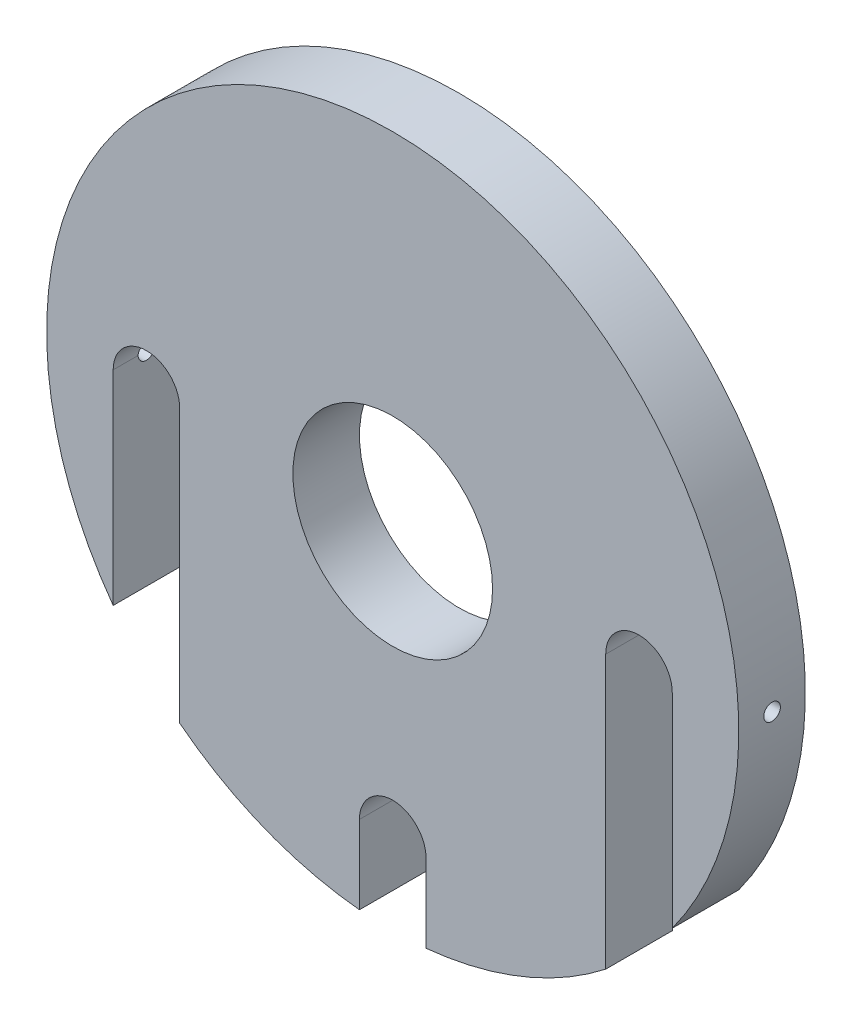
ISO-10303-21;
HEADER;
FILE_DESCRIPTION(('STEP AP214'),'2;1');
FILE_NAME('part.step','',(''),(''),'','','');
FILE_SCHEMA(('AUTOMOTIVE_DESIGN { 1 0 10303 214 1 1 1 1 }'));
ENDSEC;
DATA;
#1=APPLICATION_CONTEXT('core data for automotive mechanical design processes');
#2=APPLICATION_PROTOCOL_DEFINITION('international standard','automotive_design',2000,#1);
#3=PRODUCT_CONTEXT('',#1,'mechanical');
#4=PRODUCT('Part','Part','',(#3));
#5=PRODUCT_RELATED_PRODUCT_CATEGORY('part','',(#4));
#6=PRODUCT_DEFINITION_FORMATION('','',#4);
#7=PRODUCT_DEFINITION_CONTEXT('part definition',#1,'design');
#8=PRODUCT_DEFINITION('design','',#6,#7);
#9=PRODUCT_DEFINITION_SHAPE('','',#8);
#10=(LENGTH_UNIT() NAMED_UNIT(*) SI_UNIT(.MILLI.,.METRE.));
#11=(NAMED_UNIT(*) PLANE_ANGLE_UNIT() SI_UNIT($,.RADIAN.));
#12=(NAMED_UNIT(*) SI_UNIT($,.STERADIAN.) SOLID_ANGLE_UNIT());
#13=UNCERTAINTY_MEASURE_WITH_UNIT(LENGTH_MEASURE(1.E-05),#10,'distance_accuracy_value','');
#14=(GEOMETRIC_REPRESENTATION_CONTEXT(3) GLOBAL_UNCERTAINTY_ASSIGNED_CONTEXT((#13)) GLOBAL_UNIT_ASSIGNED_CONTEXT((#10,
#11,#12)) REPRESENTATION_CONTEXT('',''));
#15=CARTESIAN_POINT('',(0.,0.,0.));
#16=DIRECTION('',(0.,0.,1.));
#17=DIRECTION('',(1.,0.,0.));
#18=AXIS2_PLACEMENT_3D('',#15,#16,#17);
#19=CARTESIAN_POINT('',(0.,0.,10.));
#20=DIRECTION('',(0.,0.,-1.));
#21=DIRECTION('',(-1.,0.,0.));
#22=AXIS2_PLACEMENT_3D('',#19,#20,#21);
#23=CYLINDRICAL_SURFACE('',#22,52.);
#24=CARTESIAN_POINT('',(-52.,0.,6.24999999999998));
#25=CARTESIAN_POINT('',(-51.9999997973088,-0.0702021682379091,6.2499968895859));
#26=CARTESIAN_POINT('',(-51.9998563106322,-0.140454981450219,6.24406613697119));
#27=CARTESIAN_POINT('',(-51.9992977076912,-0.279025062442822,6.22048990731504));
#28=CARTESIAN_POINT('',(-51.9988822660825,-0.347339909542774,6.20283039859609));
#29=CARTESIAN_POINT('',(-51.9978268062926,-0.480006521059341,6.15630034243218));
#30=CARTESIAN_POINT('',(-51.9971868970592,-0.544360190296536,6.12743523302246));
#31=CARTESIAN_POINT('',(-51.99575470482,-0.667290330916391,6.05932103250131));
#32=CARTESIAN_POINT('',(-51.9949624592714,-0.725868217133678,6.02007449314121));
#33=CARTESIAN_POINT('',(-51.9933145118695,-0.835622281287134,5.93229518490517));
#34=CARTESIAN_POINT('',(-51.9924587919931,-0.886796344683112,5.88375977227363));
#35=CARTESIAN_POINT('',(-51.9907805017499,-0.980272477518451,5.77878464423165));
#36=CARTESIAN_POINT('',(-51.9899579326977,-1.02257419539248,5.72234461574973));
#37=CARTESIAN_POINT('',(-51.9884386379106,-1.09710658397418,5.60315653739074));
#38=CARTESIAN_POINT('',(-51.9877419250816,-1.12933622208278,5.54040784161421));
#39=CARTESIAN_POINT('',(-51.9865530394971,-1.18280274961246,5.41038828850494));
#40=CARTESIAN_POINT('',(-51.9860608660679,-1.2040396752478,5.34311744607073));
#41=CARTESIAN_POINT('',(-51.9853366659506,-1.23491404263499,5.20597695611337));
#42=CARTESIAN_POINT('',(-51.9851045888189,-1.24455373360457,5.13610781522614));
#43=CARTESIAN_POINT('',(-51.9849265963996,-1.25196691572491,4.99574265089226));
#44=CARTESIAN_POINT('',(-51.9849806801941,-1.2497404449398,4.92524662945722));
#45=CARTESIAN_POINT('',(-51.985368863679,-1.23348643261604,4.78564409487549));
#46=CARTESIAN_POINT('',(-51.9857029055237,-1.21946132894386,4.71653729770342));
#47=CARTESIAN_POINT('',(-51.9866132562613,-1.1800119384044,4.58165935292268));
#48=CARTESIAN_POINT('',(-51.9871895655884,-1.15458763111172,4.51588821129117));
#49=CARTESIAN_POINT('',(-51.9885195484886,-1.09305874317991,4.38954078401926));
#50=CARTESIAN_POINT('',(-51.9892732406284,-1.05695304442013,4.32896504308654));
#51=CARTESIAN_POINT('',(-51.990873002452,-0.97508713050876,4.21473394256006));
#52=CARTESIAN_POINT('',(-51.9917190722579,-0.929326902589633,4.16107859211825));
#53=CARTESIAN_POINT('',(-51.9934084662207,-0.829437096207218,4.06219713975511));
#54=CARTESIAN_POINT('',(-51.9942517896282,-0.77530540162422,4.01697317549234));
#55=CARTESIAN_POINT('',(-51.9958404123069,-0.660216745710646,3.93625470582223));
#56=CARTESIAN_POINT('',(-51.9965857115635,-0.599259783359249,3.90076020187007));
#57=CARTESIAN_POINT('',(-51.9978942729366,-0.472249784187237,3.84050847217416));
#58=CARTESIAN_POINT('',(-51.9984575339415,-0.406196716252543,3.81575131199297));
#59=CARTESIAN_POINT('',(-51.9993385031685,-0.270870063484839,3.77767840062746));
#60=CARTESIAN_POINT('',(-51.9996562118238,-0.201596484331865,3.76436262926472));
#61=CARTESIAN_POINT('',(-52.0000102059479,-0.0618138289347149,3.7495531009642));
#62=CARTESIAN_POINT('',(-52.000046561819,0.00869493380591818,3.74805638656743));
#63=CARTESIAN_POINT('',(-51.9998339383627,0.148962758512663,3.75691975412827));
#64=CARTESIAN_POINT('',(-51.9995849592427,0.218721821024188,3.76727982745936));
#65=CARTESIAN_POINT('',(-51.9988297750903,0.355501780963677,3.79956023565669));
#66=CARTESIAN_POINT('',(-51.9983235998992,0.422522995077548,3.82147922940406));
#67=CARTESIAN_POINT('',(-51.9971110723133,0.551934463575331,3.8762539091937));
#68=CARTESIAN_POINT('',(-51.9964047196695,0.614324712193831,3.90910960885154));
#69=CARTESIAN_POINT('',(-51.9948712563162,0.732716819717158,3.98483266008584));
#70=CARTESIAN_POINT('',(-51.9940441215981,0.788717404551271,4.02770200316391));
#71=CARTESIAN_POINT('',(-51.9923624047139,0.892727732221843,4.12223250589846));
#72=CARTESIAN_POINT('',(-51.9915078224988,0.940737460803128,4.17389368123867));
#73=CARTESIAN_POINT('',(-51.9898673530022,1.02741309597303,4.28455402755676));
#74=CARTESIAN_POINT('',(-51.9890814797713,1.06607709425557,4.34355469346742));
#75=CARTESIAN_POINT('',(-51.9876672523362,1.13295066954025,4.46721152634058));
#76=CARTESIAN_POINT('',(-51.9870388978446,1.16116026562596,4.53186768297923));
#77=CARTESIAN_POINT('',(-51.9860106523504,1.20632093427851,4.66499293625244));
#78=CARTESIAN_POINT('',(-51.9856107362014,1.22327324608078,4.73346161229381));
#79=CARTESIAN_POINT('',(-51.9850843853326,1.2454421997953,4.87227432871524));
#80=CARTESIAN_POINT('',(-51.9849579506351,1.25065884075391,4.94261836924769));
#81=CARTESIAN_POINT('',(-51.9849928270816,1.24920821155983,5.08316579760952));
#82=CARTESIAN_POINT('',(-51.9851540651841,1.24254395802412,5.1533692166126));
#83=CARTESIAN_POINT('',(-51.9857459567771,1.2175269006696,5.29166052483359));
#84=CARTESIAN_POINT('',(-51.9861766108046,1.19917407354676,5.35974840983338));
#85=CARTESIAN_POINT('',(-51.9872587776231,1.15130109720322,5.49187742806503));
#86=CARTESIAN_POINT('',(-51.9879102943159,1.12178075069791,5.55591848978267));
#87=CARTESIAN_POINT('',(-51.9893607075731,1.05241220497476,5.67813381072752));
#88=CARTESIAN_POINT('',(-51.9901595986442,1.01256439069638,5.73630828850982));
#89=CARTESIAN_POINT('',(-51.9918148783833,0.923664897688957,5.84515186657948));
#90=CARTESIAN_POINT('',(-51.9926712755141,0.874611862405308,5.8958198586795));
#91=CARTESIAN_POINT('',(-51.9943451605303,0.768681394127143,5.98821499771678));
#92=CARTESIAN_POINT('',(-51.9951626387157,0.711802024121723,6.02993992469413));
#93=CARTESIAN_POINT('',(-51.9966667561658,0.591815674581007,6.10326914926611));
#94=CARTESIAN_POINT('',(-51.9973533183665,0.528705059981918,6.13486749323264));
#95=CARTESIAN_POINT('',(-51.998516752348,0.398121934825982,6.18698344501717));
#96=CARTESIAN_POINT('',(-51.9989938745281,0.330654744203557,6.20751429148876));
#97=CARTESIAN_POINT('',(-51.9995568847217,0.218966673448215,6.23146046341417));
#98=CARTESIAN_POINT('',(-51.9997223338094,0.175471022833649,6.23840406759431));
#99=CARTESIAN_POINT('',(-51.9999439549651,0.087990214559126,6.24767481030989));
#100=CARTESIAN_POINT('',(-52.0000001270536,0.0440050569909726,6.25000194971111));
#101=CARTESIAN_POINT('',(-52.,0.,6.24999999999998));
#102=B_SPLINE_CURVE_WITH_KNOTS('',3,(#24,#25,#26,#27,#28,#29,#30,#31,#32,#33,#34,#35,#36,#37,
#38,#39,#40,#41,#42,#43,#44,#45,#46,#47,#48,#49,#50,#51,#52,#53,#54,#55,#56,#57,#58,#59,#60,#61,
#62,#63,#64,#65,#66,#67,#68,#69,#70,#71,#72,#73,#74,#75,#76,#77,#78,#79,#80,#81,#82,#83,#84,#85,
#86,#87,#88,#89,#90,#91,#92,#93,#94,#95,#96,#97,#98,#99,#100,#101),.UNSPECIFIED.,.T.,.F.,(4,2,2,
2,2,2,2,2,2,2,2,2,2,2,2,2,2,2,2,2,2,2,2,2,2,2,2,2,2,2,2,2,2,2,2,2,2,2,4),(0.,0.210445882634705,
0.421143986444405,0.631739966835604,0.842284230842992,1.052888508329,1.2635011294014,
1.47413533559935,1.68476884788204,1.89536150240385,2.1059534813895,2.31650195795665,
2.52705081179168,2.73762171353813,2.94819289375379,3.15881738892334,3.36944191559497,
3.58006772832851,3.79069316959421,4.00126590480604,4.2118384868137,4.42238664260014,
4.63293506050825,4.84352538774352,5.05411609065432,5.26474975785616,5.4753830405633,
5.68599313228496,5.89660324112071,6.10715988263968,6.31771694395633,6.52827772513291,
6.73883065912926,6.94941464628273,7.16005084685117,7.37081065858985,7.58131780231657,
7.71323231476071,7.84514680246531),.UNSPECIFIED.);
#103=CARTESIAN_POINT('',(-52.,0.,6.24999999999998));
#104=VERTEX_POINT('',#103);
#105=EDGE_CURVE('E152',#104,#104,#102,.T.);
#106=ORIENTED_EDGE('',*,*,#105,.T.);
#107=EDGE_LOOP('',(#106));
#108=FACE_BOUND('',#107,.T.);
#109=CARTESIAN_POINT('',(52.,0.,3.75));
#110=CARTESIAN_POINT('',(51.9999997973088,-0.0702021682379091,3.75000311041408));
#111=CARTESIAN_POINT('',(51.9998563106322,-0.140454981450219,3.75593386302879));
#112=CARTESIAN_POINT('',(51.9992977076912,-0.279025062442822,3.77951009268494));
#113=CARTESIAN_POINT('',(51.9988822660825,-0.347339909542774,3.79716960140389));
#114=CARTESIAN_POINT('',(51.9978268062926,-0.480006521059341,3.8436996575678));
#115=CARTESIAN_POINT('',(51.9971868970592,-0.544360190296535,3.87256476697752));
#116=CARTESIAN_POINT('',(51.99575470482,-0.66729033091639,3.94067896749867));
#117=CARTESIAN_POINT('',(51.9949624592714,-0.725868217133678,3.97992550685877));
#118=CARTESIAN_POINT('',(51.9933145118695,-0.835622281287134,4.06770481509481));
#119=CARTESIAN_POINT('',(51.9924587919931,-0.886796344683112,4.11624022772634));
#120=CARTESIAN_POINT('',(51.9907805017499,-0.980272477518451,4.22121535576833));
#121=CARTESIAN_POINT('',(51.9899579326977,-1.02257419539248,4.27765538425025));
#122=CARTESIAN_POINT('',(51.9884386379106,-1.09710658397418,4.39684346260924));
#123=CARTESIAN_POINT('',(51.9877419250816,-1.12933622208278,4.45959215838577));
#124=CARTESIAN_POINT('',(51.9865530394971,-1.18280274961246,4.58961171149504));
#125=CARTESIAN_POINT('',(51.9860608660679,-1.2040396752478,4.65688255392925));
#126=CARTESIAN_POINT('',(51.9853366659506,-1.23491404263499,4.79402304388661));
#127=CARTESIAN_POINT('',(51.9851045888189,-1.24455373360457,4.86389218477383));
#128=CARTESIAN_POINT('',(51.9849265963996,-1.25196691572491,5.00425734910772));
#129=CARTESIAN_POINT('',(51.9849806801941,-1.2497404449398,5.07475337054276));
#130=CARTESIAN_POINT('',(51.985368863679,-1.23348643261604,5.21435590512448));
#131=CARTESIAN_POINT('',(51.9857029055237,-1.21946132894386,5.28346270229655));
#132=CARTESIAN_POINT('',(51.9866132562613,-1.1800119384044,5.41834064707729));
#133=CARTESIAN_POINT('',(51.9871895655884,-1.15458763111172,5.48411178870881));
#134=CARTESIAN_POINT('',(51.9885195484886,-1.09305874317991,5.61045921598072));
#135=CARTESIAN_POINT('',(51.9892732406284,-1.05695304442013,5.67103495691344));
#136=CARTESIAN_POINT('',(51.990873002452,-0.97508713050876,5.78526605743992));
#137=CARTESIAN_POINT('',(51.9917190722579,-0.929326902589633,5.83892140788173));
#138=CARTESIAN_POINT('',(51.9934084662207,-0.829437096207218,5.93780286024487));
#139=CARTESIAN_POINT('',(51.9942517896282,-0.775305401624221,5.98302682450764));
#140=CARTESIAN_POINT('',(51.9958404123069,-0.660216745710647,6.06374529417775));
#141=CARTESIAN_POINT('',(51.9965857115635,-0.59925978335925,6.09923979812991));
#142=CARTESIAN_POINT('',(51.9978942729366,-0.472249784187238,6.15949152782582));
#143=CARTESIAN_POINT('',(51.9984575339415,-0.406196716252543,6.18424868800701));
#144=CARTESIAN_POINT('',(51.9993385031685,-0.27087006348484,6.22232159937251));
#145=CARTESIAN_POINT('',(51.9996562118238,-0.201596484331865,6.23563737073526));
#146=CARTESIAN_POINT('',(52.0000102059479,-0.0618138289347151,6.25044689903578));
#147=CARTESIAN_POINT('',(52.000046561819,0.00869493380591806,6.25194361343255));
#148=CARTESIAN_POINT('',(51.9998339383627,0.148962758512663,6.24308024587171));
#149=CARTESIAN_POINT('',(51.9995849592427,0.218721821024188,6.23272017254062));
#150=CARTESIAN_POINT('',(51.9988297750903,0.355501780963677,6.20043976434329));
#151=CARTESIAN_POINT('',(51.9983235998992,0.422522995077549,6.17852077059591));
#152=CARTESIAN_POINT('',(51.9971110723133,0.551934463575331,6.12374609080628));
#153=CARTESIAN_POINT('',(51.9964047196695,0.614324712193831,6.09089039114844));
#154=CARTESIAN_POINT('',(51.9948712563162,0.732716819717158,6.01516733991414));
#155=CARTESIAN_POINT('',(51.9940441215981,0.788717404551271,5.97229799683607));
#156=CARTESIAN_POINT('',(51.9923624047139,0.892727732221843,5.87776749410152));
#157=CARTESIAN_POINT('',(51.9915078224988,0.940737460803128,5.82610631876131));
#158=CARTESIAN_POINT('',(51.9898673530022,1.02741309597303,5.71544597244322));
#159=CARTESIAN_POINT('',(51.9890814797713,1.06607709425557,5.65644530653256));
#160=CARTESIAN_POINT('',(51.9876672523362,1.13295066954025,5.5327884736594));
#161=CARTESIAN_POINT('',(51.9870388978446,1.16116026562596,5.46813231702075));
#162=CARTESIAN_POINT('',(51.9860106523504,1.20632093427851,5.33500706374754));
#163=CARTESIAN_POINT('',(51.9856107362014,1.22327324608078,5.26653838770617));
#164=CARTESIAN_POINT('',(51.9850843853326,1.2454421997953,5.12772567128474));
#165=CARTESIAN_POINT('',(51.9849579506351,1.25065884075391,5.05738163075229));
#166=CARTESIAN_POINT('',(51.9849928270816,1.24920821155983,4.91683420239045));
#167=CARTESIAN_POINT('',(51.9851540651841,1.24254395802412,4.84663078338738));
#168=CARTESIAN_POINT('',(51.9857459567771,1.2175269006696,4.70833947516639));
#169=CARTESIAN_POINT('',(51.9861766108046,1.19917407354676,4.6402515901666));
#170=CARTESIAN_POINT('',(51.9872587776231,1.15130109720322,4.50812257193495));
#171=CARTESIAN_POINT('',(51.9879102943159,1.12178075069791,4.44408151021731));
#172=CARTESIAN_POINT('',(51.9893607075731,1.05241220497476,4.32186618927245));
#173=CARTESIAN_POINT('',(51.9901595986442,1.01256439069638,4.26369171149015));
#174=CARTESIAN_POINT('',(51.9918148783833,0.923664897688957,4.15484813342049));
#175=CARTESIAN_POINT('',(51.9926712755141,0.874611862405308,4.10418014132048));
#176=CARTESIAN_POINT('',(51.9943451605303,0.768681394127143,4.01178500228319));
#177=CARTESIAN_POINT('',(51.9951626387157,0.711802024121723,3.97006007530585));
#178=CARTESIAN_POINT('',(51.9966667561658,0.591815674581007,3.89673085073387));
#179=CARTESIAN_POINT('',(51.9973533183665,0.528705059981918,3.86513250676734));
#180=CARTESIAN_POINT('',(51.998516752348,0.398121934825982,3.81301655498281));
#181=CARTESIAN_POINT('',(51.9989938745281,0.330654744203557,3.79248570851122));
#182=CARTESIAN_POINT('',(51.9995568847217,0.218966673448215,3.76853953658581));
#183=CARTESIAN_POINT('',(51.9997223338094,0.175471022833649,3.76159593240567));
#184=CARTESIAN_POINT('',(51.9999439549651,0.087990214559126,3.75232518969009));
#185=CARTESIAN_POINT('',(52.0000001270536,0.0440050569909727,3.74999805028887));
#186=CARTESIAN_POINT('',(52.,0.,3.75));
#187=B_SPLINE_CURVE_WITH_KNOTS('',3,(#109,#110,#111,#112,#113,#114,#115,#116,#117,#118,#119,
#120,#121,#122,#123,#124,#125,#126,#127,#128,#129,#130,#131,#132,#133,#134,#135,#136,#137,#138,
#139,#140,#141,#142,#143,#144,#145,#146,#147,#148,#149,#150,#151,#152,#153,#154,#155,#156,#157,
#158,#159,#160,#161,#162,#163,#164,#165,#166,#167,#168,#169,#170,#171,#172,#173,#174,#175,#176,
#177,#178,#179,#180,#181,#182,#183,#184,#185,#186),.UNSPECIFIED.,.T.,.F.,(4,2,2,2,2,2,2,2,2,2,2,
2,2,2,2,2,2,2,2,2,2,2,2,2,2,2,2,2,2,2,2,2,2,2,2,2,2,2,4),(0.,0.210445882634705,
0.421143986444404,0.631739966835603,0.842284230842992,1.052888508329,1.2635011294014,
1.47413533559935,1.68476884788204,1.89536150240385,2.1059534813895,2.31650195795665,
2.52705081179168,2.73762171353813,2.94819289375379,3.15881738892333,3.36944191559497,
3.58006772832851,3.79069316959421,4.00126590480604,4.2118384868137,4.42238664260014,
4.63293506050825,4.84352538774352,5.05411609065432,5.26474975785616,5.4753830405633,
5.68599313228496,5.89660324112071,6.10715988263968,6.31771694395633,6.52827772513291,
6.73883065912926,6.94941464628273,7.16005084685117,7.37081065858985,7.58131780231657,
7.71323231476071,7.84514680246531),.UNSPECIFIED.);
#188=CARTESIAN_POINT('',(52.,0.,3.75));
#189=VERTEX_POINT('',#188);
#190=EDGE_CURVE('E246',#189,#189,#187,.T.);
#191=ORIENTED_EDGE('',*,*,#190,.T.);
#192=EDGE_LOOP('',(#191));
#193=FACE_BOUND('',#192,.T.);
#194=CARTESIAN_POINT('',(0.,0.,10.));
#195=DIRECTION('',(0.,0.,1.));
#196=DIRECTION('',(1.,0.,0.));
#197=AXIS2_PLACEMENT_3D('',#194,#195,#196);
#198=CIRCLE('',#197,52.);
#199=CARTESIAN_POINT('',(42.,-30.6594194335118,10.));
#200=VERTEX_POINT('',#199);
#201=CARTESIAN_POINT('',(-42.,-30.6594194335118,10.));
#202=VERTEX_POINT('',#201);
#203=EDGE_CURVE('E207',#200,#202,#198,.T.);
#204=ORIENTED_EDGE('',*,*,#203,.F.);
#205=DIRECTION('',(0.,0.,-1.));
#206=VECTOR('',#205,1.);
#207=CARTESIAN_POINT('',(42.,-30.6594194335118,10.));
#208=LINE('',#207,#206);
#209=CARTESIAN_POINT('',(42.,-30.6594194335118,0.));
#210=VERTEX_POINT('',#209);
#211=EDGE_CURVE('E203',#200,#210,#208,.T.);
#212=ORIENTED_EDGE('',*,*,#211,.T.);
#213=CARTESIAN_POINT('',(0.,0.,0.));
#214=DIRECTION('',(0.,0.,1.));
#215=DIRECTION('',(1.,0.,0.));
#216=AXIS2_PLACEMENT_3D('',#213,#214,#215);
#217=CIRCLE('',#216,52.);
#218=CARTESIAN_POINT('',(-42.,-30.6594194335118,0.));
#219=VERTEX_POINT('',#218);
#220=EDGE_CURVE('E206',#210,#219,#217,.T.);
#221=ORIENTED_EDGE('',*,*,#220,.T.);
#222=DIRECTION('',(0.,0.,-1.));
#223=VECTOR('',#222,1.);
#224=CARTESIAN_POINT('',(-42.,-30.6594194335118,10.));
#225=LINE('',#224,#223);
#226=EDGE_CURVE('E194',#219,#202,#225,.F.);
#227=ORIENTED_EDGE('',*,*,#226,.T.);
#228=EDGE_LOOP('',(#204,#212,#221,#227));
#229=FACE_BOUND('',#228,.T.);
#230=ADVANCED_FACE('F39',(#108,#193,#229),#23,.T.);
#231=CARTESIAN_POINT('',(-32.,-40.9878030638384,10.));
#232=VERTEX_POINT('',#231);
#233=CARTESIAN_POINT('',(-5.,-51.7590571784301,10.));
#234=VERTEX_POINT('',#233);
#235=EDGE_CURVE('E212',#232,#234,#198,.T.);
#236=ORIENTED_EDGE('',*,*,#235,.F.);
#237=DIRECTION('',(0.,0.,-1.));
#238=VECTOR('',#237,1.);
#239=CARTESIAN_POINT('',(-32.,-40.9878030638384,10.));
#240=LINE('',#239,#238);
#241=CARTESIAN_POINT('',(-32.,-40.9878030638384,0.));
#242=VERTEX_POINT('',#241);
#243=EDGE_CURVE('E197',#232,#242,#240,.T.);
#244=ORIENTED_EDGE('',*,*,#243,.T.);
#245=CARTESIAN_POINT('',(-5.,-51.7590571784301,0.));
#246=VERTEX_POINT('',#245);
#247=EDGE_CURVE('E211',#242,#246,#217,.T.);
#248=ORIENTED_EDGE('',*,*,#247,.T.);
#249=DIRECTION('',(0.,0.,-1.));
#250=VECTOR('',#249,1.);
#251=CARTESIAN_POINT('',(-5.,-51.7590571784301,10.));
#252=LINE('',#251,#250);
#253=EDGE_CURVE('E187',#246,#234,#252,.F.);
#254=ORIENTED_EDGE('',*,*,#253,.T.);
#255=EDGE_LOOP('',(#236,#244,#248,#254));
#256=FACE_BOUND('',#255,.T.);
#257=ADVANCED_FACE('F240',(#256),#23,.T.);
#258=CARTESIAN_POINT('',(5.,-51.7590571784301,0.));
#259=VERTEX_POINT('',#258);
#260=CARTESIAN_POINT('',(32.,-40.9878030638384,0.));
#261=VERTEX_POINT('',#260);
#262=EDGE_CURVE('E215',#259,#261,#217,.T.);
#263=ORIENTED_EDGE('',*,*,#262,.T.);
#264=DIRECTION('',(0.,0.,-1.));
#265=VECTOR('',#264,1.);
#266=CARTESIAN_POINT('',(32.,-40.9878030638384,10.));
#267=LINE('',#266,#265);
#268=CARTESIAN_POINT('',(32.,-40.9878030638384,10.));
#269=VERTEX_POINT('',#268);
#270=EDGE_CURVE('E200',#261,#269,#267,.F.);
#271=ORIENTED_EDGE('',*,*,#270,.T.);
#272=CARTESIAN_POINT('',(5.,-51.7590571784301,10.));
#273=VERTEX_POINT('',#272);
#274=EDGE_CURVE('E210',#273,#269,#198,.T.);
#275=ORIENTED_EDGE('',*,*,#274,.F.);
#276=DIRECTION('',(0.,0.,-1.));
#277=VECTOR('',#276,1.);
#278=CARTESIAN_POINT('',(5.,-51.7590571784301,10.));
#279=LINE('',#278,#277);
#280=EDGE_CURVE('E190',#273,#259,#279,.T.);
#281=ORIENTED_EDGE('',*,*,#280,.T.);
#282=EDGE_LOOP('',(#263,#271,#275,#281));
#283=FACE_BOUND('',#282,.T.);
#284=ADVANCED_FACE('F235',(#283),#23,.T.);
#285=CARTESIAN_POINT('',(0.,0.,10.));
#286=DIRECTION('',(0.,0.,1.));
#287=DIRECTION('',(1.,0.,0.));
#288=AXIS2_PLACEMENT_3D('',#285,#286,#287);
#289=PLANE('',#288);
#290=CARTESIAN_POINT('',(0.,0.,10.));
#291=DIRECTION('',(0.,0.,1.));
#292=DIRECTION('',(1.,0.,0.));
#293=AXIS2_PLACEMENT_3D('',#290,#291,#292);
#294=CIRCLE('',#293,15.);
#295=CARTESIAN_POINT('',(15.,0.,10.));
#296=VERTEX_POINT('',#295);
#297=EDGE_CURVE('E340',#296,#296,#294,.T.);
#298=ORIENTED_EDGE('',*,*,#297,.F.);
#299=EDGE_LOOP('',(#298));
#300=FACE_BOUND('',#299,.T.);
#301=DIRECTION('',(0.,1.,0.));
#302=VECTOR('',#301,1.);
#303=CARTESIAN_POINT('',(42.,3.54103707564824E-07,10.));
#304=LINE('',#303,#302);
#305=CARTESIAN_POINT('',(42.,3.54103706807145E-07,10.));
#306=VERTEX_POINT('',#305);
#307=EDGE_CURVE('E296',#200,#306,#304,.T.);
#308=ORIENTED_EDGE('',*,*,#307,.F.);
#309=ORIENTED_EDGE('',*,*,#203,.T.);
#310=DIRECTION('',(0.,-1.,0.));
#311=VECTOR('',#310,1.);
#312=CARTESIAN_POINT('',(-42.,3.54103707564824E-07,10.));
#313=LINE('',#312,#311);
#314=CARTESIAN_POINT('',(-42.,3.54103707564824E-07,10.));
#315=VERTEX_POINT('',#314);
#316=EDGE_CURVE('E293',#315,#202,#313,.T.);
#317=ORIENTED_EDGE('',*,*,#316,.F.);
#318=CARTESIAN_POINT('',(-37.,0.,10.));
#319=DIRECTION('',(0.,0.,1.));
#320=DIRECTION('',(1.,0.,0.));
#321=AXIS2_PLACEMENT_3D('',#318,#319,#320);
#322=CIRCLE('',#321,5.00000000000001);
#323=CARTESIAN_POINT('',(-32.,0.,10.));
#324=VERTEX_POINT('',#323);
#325=EDGE_CURVE('E157',#324,#315,#322,.T.);
#326=ORIENTED_EDGE('',*,*,#325,.F.);
#327=DIRECTION('',(0.,1.,0.));
#328=VECTOR('',#327,1.);
#329=CARTESIAN_POINT('',(-32.,0.,10.));
#330=LINE('',#329,#328);
#331=EDGE_CURVE('E316',#232,#324,#330,.T.);
#332=ORIENTED_EDGE('',*,*,#331,.F.);
#333=ORIENTED_EDGE('',*,*,#235,.T.);
#334=DIRECTION('',(0.,-1.,0.));
#335=VECTOR('',#334,1.);
#336=CARTESIAN_POINT('',(-5.,-39.9999996458963,10.));
#337=LINE('',#336,#335);
#338=CARTESIAN_POINT('',(-5.,-39.9999996458963,10.));
#339=VERTEX_POINT('',#338);
#340=EDGE_CURVE('E172',#339,#234,#337,.T.);
#341=ORIENTED_EDGE('',*,*,#340,.F.);
#342=CARTESIAN_POINT('',(0.,-40.,10.));
#343=DIRECTION('',(0.,0.,1.));
#344=DIRECTION('',(1.,0.,0.));
#345=AXIS2_PLACEMENT_3D('',#342,#343,#344);
#346=CIRCLE('',#345,5.00000000000001);
#347=CARTESIAN_POINT('',(5.00000000000001,-40.,10.));
#348=VERTEX_POINT('',#347);
#349=EDGE_CURVE('E178',#348,#339,#346,.T.);
#350=ORIENTED_EDGE('',*,*,#349,.F.);
#351=DIRECTION('',(0.,1.,0.));
#352=VECTOR('',#351,1.);
#353=CARTESIAN_POINT('',(5.00000000000001,-40.,10.));
#354=LINE('',#353,#352);
#355=EDGE_CURVE('E176',#273,#348,#354,.T.);
#356=ORIENTED_EDGE('',*,*,#355,.F.);
#357=ORIENTED_EDGE('',*,*,#274,.T.);
#358=DIRECTION('',(0.,-1.,0.));
#359=VECTOR('',#358,1.);
#360=CARTESIAN_POINT('',(32.,0.,10.));
#361=LINE('',#360,#359);
#362=CARTESIAN_POINT('',(32.,0.,10.));
#363=VERTEX_POINT('',#362);
#364=EDGE_CURVE('E302',#363,#269,#361,.T.);
#365=ORIENTED_EDGE('',*,*,#364,.F.);
#366=CARTESIAN_POINT('',(37.,0.,10.));
#367=DIRECTION('',(0.,0.,1.));
#368=DIRECTION('',(-1.,0.,0.));
#369=AXIS2_PLACEMENT_3D('',#366,#367,#368);
#370=CIRCLE('',#369,5.00000000000001);
#371=EDGE_CURVE('E299',#306,#363,#370,.T.);
#372=ORIENTED_EDGE('',*,*,#371,.F.);
#373=EDGE_LOOP('',(#308,#309,#317,#326,#332,#333,#341,#350,#356,#357,#365,#372));
#374=FACE_BOUND('',#373,.T.);
#375=ADVANCED_FACE('F239',(#300,#374),#289,.T.);
#376=CARTESIAN_POINT('',(0.,0.,0.));
#377=DIRECTION('',(0.,0.,1.));
#378=DIRECTION('',(1.,0.,0.));
#379=AXIS2_PLACEMENT_3D('',#376,#377,#378);
#380=PLANE('',#379);
#381=CARTESIAN_POINT('',(0.,0.,0.));
#382=DIRECTION('',(0.,0.,1.));
#383=DIRECTION('',(1.,0.,0.));
#384=AXIS2_PLACEMENT_3D('',#381,#382,#383);
#385=CIRCLE('',#384,15.);
#386=CARTESIAN_POINT('',(15.,0.,0.));
#387=VERTEX_POINT('',#386);
#388=EDGE_CURVE('E179',#387,#387,#385,.T.);
#389=ORIENTED_EDGE('',*,*,#388,.T.);
#390=EDGE_LOOP('',(#389));
#391=FACE_BOUND('',#390,.T.);
#392=ORIENTED_EDGE('',*,*,#220,.F.);
#393=DIRECTION('',(0.,1.,0.));
#394=VECTOR('',#393,1.);
#395=CARTESIAN_POINT('',(42.,0.,0.));
#396=LINE('',#395,#394);
#397=CARTESIAN_POINT('',(42.,3.54103706807145E-07,0.));
#398=VERTEX_POINT('',#397);
#399=EDGE_CURVE('E222',#210,#398,#396,.T.);
#400=ORIENTED_EDGE('',*,*,#399,.T.);
#401=CARTESIAN_POINT('',(37.,0.,0.));
#402=DIRECTION('',(0.,0.,1.));
#403=DIRECTION('',(-1.,0.,0.));
#404=AXIS2_PLACEMENT_3D('',#401,#402,#403);
#405=CIRCLE('',#404,5.00000000000001);
#406=CARTESIAN_POINT('',(32.,0.,0.));
#407=VERTEX_POINT('',#406);
#408=EDGE_CURVE('E309',#398,#407,#405,.T.);
#409=ORIENTED_EDGE('',*,*,#408,.T.);
#410=DIRECTION('',(0.,-1.,0.));
#411=VECTOR('',#410,1.);
#412=CARTESIAN_POINT('',(32.,0.,0.));
#413=LINE('',#412,#411);
#414=EDGE_CURVE('E305',#407,#261,#413,.T.);
#415=ORIENTED_EDGE('',*,*,#414,.T.);
#416=ORIENTED_EDGE('',*,*,#262,.F.);
#417=DIRECTION('',(0.,1.,0.));
#418=VECTOR('',#417,1.);
#419=CARTESIAN_POINT('',(5.00000000000005,0.,0.));
#420=LINE('',#419,#418);
#421=CARTESIAN_POINT('',(5.00000000000001,-40.,0.));
#422=VERTEX_POINT('',#421);
#423=EDGE_CURVE('E216',#259,#422,#420,.T.);
#424=ORIENTED_EDGE('',*,*,#423,.T.);
#425=CARTESIAN_POINT('',(0.,-40.,0.));
#426=DIRECTION('',(0.,0.,1.));
#427=DIRECTION('',(1.,0.,0.));
#428=AXIS2_PLACEMENT_3D('',#425,#426,#427);
#429=CIRCLE('',#428,5.00000000000001);
#430=CARTESIAN_POINT('',(-5.,-39.9999996458963,0.));
#431=VERTEX_POINT('',#430);
#432=EDGE_CURVE('E168',#422,#431,#429,.T.);
#433=ORIENTED_EDGE('',*,*,#432,.T.);
#434=DIRECTION('',(0.,-1.,0.));
#435=VECTOR('',#434,1.);
#436=CARTESIAN_POINT('',(-5.,-39.9999996458963,0.));
#437=LINE('',#436,#435);
#438=EDGE_CURVE('E171',#431,#246,#437,.T.);
#439=ORIENTED_EDGE('',*,*,#438,.T.);
#440=ORIENTED_EDGE('',*,*,#247,.F.);
#441=DIRECTION('',(0.,1.,0.));
#442=VECTOR('',#441,1.);
#443=CARTESIAN_POINT('',(-32.,0.,0.));
#444=LINE('',#443,#442);
#445=CARTESIAN_POINT('',(-32.,0.,0.));
#446=VERTEX_POINT('',#445);
#447=EDGE_CURVE('E219',#242,#446,#444,.T.);
#448=ORIENTED_EDGE('',*,*,#447,.T.);
#449=CARTESIAN_POINT('',(-37.,0.,0.));
#450=DIRECTION('',(0.,0.,1.));
#451=DIRECTION('',(1.,0.,0.));
#452=AXIS2_PLACEMENT_3D('',#449,#450,#451);
#453=CIRCLE('',#452,5.00000000000001);
#454=CARTESIAN_POINT('',(-42.,3.54103707564824E-07,0.));
#455=VERTEX_POINT('',#454);
#456=EDGE_CURVE('E163',#446,#455,#453,.T.);
#457=ORIENTED_EDGE('',*,*,#456,.T.);
#458=DIRECTION('',(0.,-1.,0.));
#459=VECTOR('',#458,1.);
#460=CARTESIAN_POINT('',(-42.,3.54103707564824E-07,0.));
#461=LINE('',#460,#459);
#462=EDGE_CURVE('E159',#455,#219,#461,.T.);
#463=ORIENTED_EDGE('',*,*,#462,.T.);
#464=EDGE_LOOP('',(#392,#400,#409,#415,#416,#424,#433,#439,#440,#448,#457,#463));
#465=FACE_BOUND('',#464,.T.);
#466=ADVANCED_FACE('F242',(#391,#465),#380,.F.);
#467=CARTESIAN_POINT('',(5.00000000000001,-40.,0.));
#468=DIRECTION('',(1.,0.,0.));
#469=DIRECTION('',(0.,1.,0.));
#470=AXIS2_PLACEMENT_3D('',#467,#468,#469);
#471=PLANE('',#470);
#472=ORIENTED_EDGE('',*,*,#355,.T.);
#473=DIRECTION('',(0.,0.,1.));
#474=VECTOR('',#473,1.);
#475=CARTESIAN_POINT('',(5.00000000000001,-40.,0.));
#476=LINE('',#475,#474);
#477=EDGE_CURVE('E175',#422,#348,#476,.T.);
#478=ORIENTED_EDGE('',*,*,#477,.F.);
#479=ORIENTED_EDGE('',*,*,#423,.F.);
#480=ORIENTED_EDGE('',*,*,#280,.F.);
#481=EDGE_LOOP('',(#472,#478,#479,#480));
#482=FACE_BOUND('',#481,.T.);
#483=ADVANCED_FACE('F352',(#482),#471,.F.);
#484=CARTESIAN_POINT('',(-5.,-39.9999996458963,0.));
#485=DIRECTION('',(-1.,0.,0.));
#486=DIRECTION('',(0.,0.,1.));
#487=AXIS2_PLACEMENT_3D('',#484,#485,#486);
#488=PLANE('',#487);
#489=ORIENTED_EDGE('',*,*,#438,.F.);
#490=DIRECTION('',(0.,0.,1.));
#491=VECTOR('',#490,1.);
#492=CARTESIAN_POINT('',(-5.,-39.9999996458963,0.));
#493=LINE('',#492,#491);
#494=EDGE_CURVE('E183',#431,#339,#493,.T.);
#495=ORIENTED_EDGE('',*,*,#494,.T.);
#496=ORIENTED_EDGE('',*,*,#340,.T.);
#497=ORIENTED_EDGE('',*,*,#253,.F.);
#498=EDGE_LOOP('',(#489,#495,#496,#497));
#499=FACE_BOUND('',#498,.T.);
#500=ADVANCED_FACE('F356',(#499),#488,.F.);
#501=CARTESIAN_POINT('',(0.,-40.,0.));
#502=DIRECTION('',(0.,0.,1.));
#503=DIRECTION('',(1.,0.,0.));
#504=AXIS2_PLACEMENT_3D('',#501,#502,#503);
#505=CYLINDRICAL_SURFACE('',#504,5.00000000000001);
#506=ORIENTED_EDGE('',*,*,#349,.T.);
#507=ORIENTED_EDGE('',*,*,#494,.F.);
#508=ORIENTED_EDGE('',*,*,#432,.F.);
#509=ORIENTED_EDGE('',*,*,#477,.T.);
#510=EDGE_LOOP('',(#506,#507,#508,#509));
#511=FACE_BOUND('',#510,.T.);
#512=ADVANCED_FACE('F358',(#511),#505,.F.);
#513=CARTESIAN_POINT('',(-32.,0.,0.));
#514=DIRECTION('',(1.,0.,0.));
#515=DIRECTION('',(0.,1.,0.));
#516=AXIS2_PLACEMENT_3D('',#513,#514,#515);
#517=PLANE('',#516);
#518=ORIENTED_EDGE('',*,*,#331,.T.);
#519=DIRECTION('',(0.,0.,1.));
#520=VECTOR('',#519,1.);
#521=CARTESIAN_POINT('',(-32.,0.,0.));
#522=LINE('',#521,#520);
#523=EDGE_CURVE('E161',#446,#324,#522,.T.);
#524=ORIENTED_EDGE('',*,*,#523,.F.);
#525=ORIENTED_EDGE('',*,*,#447,.F.);
#526=ORIENTED_EDGE('',*,*,#243,.F.);
#527=EDGE_LOOP('',(#518,#524,#525,#526));
#528=FACE_BOUND('',#527,.T.);
#529=ADVANCED_FACE('F321',(#528),#517,.F.);
#530=CARTESIAN_POINT('',(-42.,3.54103707564824E-07,0.));
#531=DIRECTION('',(-1.,0.,0.));
#532=DIRECTION('',(0.,-1.,0.));
#533=AXIS2_PLACEMENT_3D('',#530,#531,#532);
#534=PLANE('',#533);
#535=DIRECTION('',(0.,0.,1.));
#536=VECTOR('',#535,1.);
#537=CARTESIAN_POINT('',(-42.,3.54103707564824E-07,0.));
#538=LINE('',#537,#536);
#539=CARTESIAN_POINT('',(-42.,3.54103707564824E-07,3.75000000000004));
#540=VERTEX_POINT('',#539);
#541=EDGE_CURVE('E151',#455,#540,#538,.T.);
#542=ORIENTED_EDGE('',*,*,#541,.T.);
#543=CARTESIAN_POINT('',(-42.,1.02198095733564E-08,4.99999999999999));
#544=DIRECTION('',(-1.,0.,0.));
#545=DIRECTION('',(0.,-1.,0.));
#546=AXIS2_PLACEMENT_3D('',#543,#544,#545);
#547=CIRCLE('',#546,1.24999999999999);
#548=CARTESIAN_POINT('',(-42.,1.02198095733564E-08,6.24999999999998));
#549=VERTEX_POINT('',#548);
#550=EDGE_CURVE('E58',#540,#549,#547,.T.);
#551=ORIENTED_EDGE('',*,*,#550,.T.);
#552=EDGE_CURVE('E148',#549,#315,#538,.T.);
#553=ORIENTED_EDGE('',*,*,#552,.T.);
#554=ORIENTED_EDGE('',*,*,#316,.T.);
#555=ORIENTED_EDGE('',*,*,#226,.F.);
#556=ORIENTED_EDGE('',*,*,#462,.F.);
#557=EDGE_LOOP('',(#542,#551,#553,#554,#555,#556));
#558=FACE_BOUND('',#557,.T.);
#559=ADVANCED_FACE('F147',(#558),#534,.F.);
#560=CARTESIAN_POINT('',(-37.,0.,0.));
#561=DIRECTION('',(0.,0.,1.));
#562=DIRECTION('',(1.,0.,0.));
#563=AXIS2_PLACEMENT_3D('',#560,#561,#562);
#564=CYLINDRICAL_SURFACE('',#563,5.00000000000001);
#565=ORIENTED_EDGE('',*,*,#552,.F.);
#566=CARTESIAN_POINT('',(-42.,3.54103706807145E-07,6.24999999999993));
#567=CARTESIAN_POINT('',(-42.0000019698079,0.0345962109782526,6.25000036644965));
#568=CARTESIAN_POINT('',(-41.999640493621,0.0691749906302355,6.24856281453843));
#569=CARTESIAN_POINT('',(-41.9982116469048,0.138075044568687,6.24283186136608));
#570=CARTESIAN_POINT('',(-41.9971443861605,0.172396358064521,6.2385389042637));
#571=CARTESIAN_POINT('',(-41.9929230926927,0.274465490095277,6.22143803266554));
#572=CARTESIAN_POINT('',(-41.9887493158735,0.341513596232846,6.20440785583315));
#573=CARTESIAN_POINT('',(-41.9781308875827,0.471689335969868,6.15963550749786));
#574=CARTESIAN_POINT('',(-41.9716863215422,0.53481711695396,6.13189373898063));
#575=CARTESIAN_POINT('',(-41.9572127083487,0.655545884497706,6.06652295796593));
#576=CARTESIAN_POINT('',(-41.9491832934728,0.71314558379131,6.02889165018515));
#577=CARTESIAN_POINT('',(-41.9322287290939,0.822334029249158,5.94400065219769));
#578=CARTESIAN_POINT('',(-41.9232898465827,0.873793079816829,5.89657695299726));
#579=CARTESIAN_POINT('',(-41.9056141001334,0.968120926979007,5.79379367709673));
#580=CARTESIAN_POINT('',(-41.89687727428,1.01098811561551,5.73843261824726));
#581=CARTESIAN_POINT('',(-41.880456208843,1.08752336887309,5.62033545394083));
#582=CARTESIAN_POINT('',(-41.8727895195481,1.12104543146148,5.55750206921887));
#583=CARTESIAN_POINT('',(-41.8595788034778,1.17699870073981,5.42687248415289));
#584=CARTESIAN_POINT('',(-41.854034328476,1.19943224969228,5.35907733537491));
#585=CARTESIAN_POINT('',(-41.8458373330429,1.23212892615481,5.22188082825314));
#586=CARTESIAN_POINT('',(-41.8431291390805,1.24262670917993,5.15253879665146));
#587=CARTESIAN_POINT('',(-41.8407446774407,1.2518848522259,5.01302742101023));
#588=CARTESIAN_POINT('',(-41.8410679849135,1.25064685695674,4.9428581942745));
#589=CARTESIAN_POINT('',(-41.8446600652602,1.23665536261765,4.80548616944144));
#590=CARTESIAN_POINT('',(-41.8478572369156,1.22418177825743,4.73825269691737));
#591=CARTESIAN_POINT('',(-41.8567226560574,1.18851984215605,4.60686487881836));
#592=CARTESIAN_POINT('',(-41.8623910574518,1.16533082305401,4.54271072529921));
#593=CARTESIAN_POINT('',(-41.8756260626769,1.10865742748457,4.41855060853457));
#594=CARTESIAN_POINT('',(-41.8832112794338,1.07507132700606,4.35859314533797));
#595=CARTESIAN_POINT('',(-41.8994145015851,0.998628948008424,4.24506618898067));
#596=CARTESIAN_POINT('',(-41.908032663381,0.955771264856995,4.19149766564546));
#597=CARTESIAN_POINT('',(-41.9256313732954,0.860558326481679,4.09066921233942));
#598=CARTESIAN_POINT('',(-41.9346152608458,0.807967836714116,4.04363174638035));
#599=CARTESIAN_POINT('',(-41.9517145656479,0.69552228924927,3.95899059725206));
#600=CARTESIAN_POINT('',(-41.9598297591918,0.635665368715757,3.92138934077771));
#601=CARTESIAN_POINT('',(-41.9743191498168,0.510059515287858,3.85660376591814));
#602=CARTESIAN_POINT('',(-41.9806863198821,0.444288172439947,3.82946132036765));
#603=CARTESIAN_POINT('',(-41.9909041691564,0.3089602512585,3.78671467525122));
#604=CARTESIAN_POINT('',(-41.9947585331897,0.239409378297589,3.77109357613646));
#605=CARTESIAN_POINT('',(-41.99808972862,0.141048245351318,3.75765943707696));
#606=CARTESIAN_POINT('',(-41.9988051278615,0.112896244611568,3.75478660008232));
#607=CARTESIAN_POINT('',(-41.9997600028024,0.0565007312840116,3.75095906648548));
#608=CARTESIAN_POINT('',(-42.0000002609937,0.02825744600974,3.75000121613587));
#609=CARTESIAN_POINT('',(-42.,3.54103708319264E-07,3.75000000000003));
#610=B_SPLINE_CURVE_WITH_KNOTS('',3,(#566,#567,#568,#569,#570,#571,#572,#573,#574,#575,#576,
#577,#578,#579,#580,#581,#582,#583,#584,#585,#586,#587,#588,#589,#590,#591,#592,#593,#594,#595,
#596,#597,#598,#599,#600,#601,#602,#603,#604,#605,#606,#607,#608,#609),.UNSPECIFIED.,.F.,.F.,(4,
2,2,2,2,2,2,2,2,2,2,2,2,2,2,2,2,2,2,2,2,4),(0.,0.103722198019732,0.207428265806422,
0.414262737517451,0.621089428572451,0.827964164913954,1.0386350397302,1.24934530464218,
1.46318344716951,1.67697640065143,1.88648931302793,2.09597286366314,2.30037760140491,
2.50479507125874,2.71127937120212,2.9177949751732,3.1301776921747,3.34261497145748,
3.55589413903354,3.76885984245785,3.85372630011411,3.9384528776441),.UNSPECIFIED.);
#611=EDGE_CURVE('E11',#549,#540,#610,.T.);
#612=ORIENTED_EDGE('',*,*,#611,.T.);
#613=ORIENTED_EDGE('',*,*,#541,.F.);
#614=ORIENTED_EDGE('',*,*,#456,.F.);
#615=ORIENTED_EDGE('',*,*,#523,.T.);
#616=ORIENTED_EDGE('',*,*,#325,.T.);
#617=EDGE_LOOP('',(#565,#612,#613,#614,#615,#616));
#618=FACE_BOUND('',#617,.T.);
#619=ADVANCED_FACE('F154',(#618),#564,.F.);
#620=CARTESIAN_POINT('',(42.,3.54103707564824E-07,0.));
#621=DIRECTION('',(1.,0.,0.));
#622=DIRECTION('',(0.,1.,0.));
#623=AXIS2_PLACEMENT_3D('',#620,#621,#622);
#624=PLANE('',#623);
#625=DIRECTION('',(0.,0.,1.));
#626=VECTOR('',#625,1.);
#627=CARTESIAN_POINT('',(42.,3.54103706807145E-07,0.));
#628=LINE('',#627,#626);
#629=CARTESIAN_POINT('',(42.,3.54103706807145E-07,6.24999999999993));
#630=VERTEX_POINT('',#629);
#631=EDGE_CURVE('E314',#630,#306,#628,.T.);
#632=ORIENTED_EDGE('',*,*,#631,.F.);
#633=CARTESIAN_POINT('',(42.,1.02198095733564E-08,4.99999999999999));
#634=DIRECTION('',(1.,0.,0.));
#635=DIRECTION('',(0.,1.,0.));
#636=AXIS2_PLACEMENT_3D('',#633,#634,#635);
#637=CIRCLE('',#636,1.24999999999999);
#638=CARTESIAN_POINT('',(42.,1.02198095733564E-08,3.75));
#639=VERTEX_POINT('',#638);
#640=EDGE_CURVE('E64',#630,#639,#637,.T.);
#641=ORIENTED_EDGE('',*,*,#640,.T.);
#642=EDGE_CURVE('E311',#398,#639,#628,.T.);
#643=ORIENTED_EDGE('',*,*,#642,.F.);
#644=ORIENTED_EDGE('',*,*,#399,.F.);
#645=ORIENTED_EDGE('',*,*,#211,.F.);
#646=ORIENTED_EDGE('',*,*,#307,.T.);
#647=EDGE_LOOP('',(#632,#641,#643,#644,#645,#646));
#648=FACE_BOUND('',#647,.T.);
#649=ADVANCED_FACE('F270',(#648),#624,.F.);
#650=CARTESIAN_POINT('',(32.,0.,0.));
#651=DIRECTION('',(-1.,0.,0.));
#652=DIRECTION('',(0.,-1.,0.));
#653=AXIS2_PLACEMENT_3D('',#650,#651,#652);
#654=PLANE('',#653);
#655=ORIENTED_EDGE('',*,*,#414,.F.);
#656=DIRECTION('',(0.,0.,1.));
#657=VECTOR('',#656,1.);
#658=CARTESIAN_POINT('',(32.,0.,0.));
#659=LINE('',#658,#657);
#660=EDGE_CURVE('E191',#407,#363,#659,.T.);
#661=ORIENTED_EDGE('',*,*,#660,.T.);
#662=ORIENTED_EDGE('',*,*,#364,.T.);
#663=ORIENTED_EDGE('',*,*,#270,.F.);
#664=EDGE_LOOP('',(#655,#661,#662,#663));
#665=FACE_BOUND('',#664,.T.);
#666=ADVANCED_FACE('F268',(#665),#654,.F.);
#667=CARTESIAN_POINT('',(37.,0.,0.));
#668=DIRECTION('',(0.,0.,1.));
#669=DIRECTION('',(1.,0.,0.));
#670=AXIS2_PLACEMENT_3D('',#667,#668,#669);
#671=CYLINDRICAL_SURFACE('',#670,5.00000000000001);
#672=ORIENTED_EDGE('',*,*,#642,.T.);
#673=CARTESIAN_POINT('',(42.,3.54103706807145E-07,3.75000000000004));
#674=CARTESIAN_POINT('',(42.0000019698079,0.0345962109782527,3.74999963355033));
#675=CARTESIAN_POINT('',(41.999640493621,0.0691749906302356,3.75143718546155));
#676=CARTESIAN_POINT('',(41.9982116469048,0.138075044568687,3.7571681386339));
#677=CARTESIAN_POINT('',(41.9971443861605,0.172396358064521,3.76146109573628));
#678=CARTESIAN_POINT('',(41.9929230926927,0.274465490095277,3.77856196733444));
#679=CARTESIAN_POINT('',(41.9887493158735,0.341513596232846,3.79559214416682));
#680=CARTESIAN_POINT('',(41.9781308875827,0.471689335969868,3.84036449250212));
#681=CARTESIAN_POINT('',(41.9716863215422,0.53481711695396,3.86810626101935));
#682=CARTESIAN_POINT('',(41.9572127083487,0.655545884497706,3.93347704203405));
#683=CARTESIAN_POINT('',(41.9491832934728,0.71314558379131,3.97110834981483));
#684=CARTESIAN_POINT('',(41.9322287290939,0.822334029249158,4.05599934780229));
#685=CARTESIAN_POINT('',(41.9232898465827,0.873793079816829,4.10342304700271));
#686=CARTESIAN_POINT('',(41.9056141001334,0.968120926979008,4.20620632290325));
#687=CARTESIAN_POINT('',(41.89687727428,1.01098811561551,4.26156738175272));
#688=CARTESIAN_POINT('',(41.880456208843,1.08752336887309,4.37966454605915));
#689=CARTESIAN_POINT('',(41.8727895195481,1.12104543146148,4.44249793078111));
#690=CARTESIAN_POINT('',(41.8595788034778,1.17699870073981,4.57312751584709));
#691=CARTESIAN_POINT('',(41.854034328476,1.19943224969228,4.64092266462506));
#692=CARTESIAN_POINT('',(41.8458373330429,1.23212892615481,4.77811917174683));
#693=CARTESIAN_POINT('',(41.8431291390805,1.24262670917993,4.84746120334852));
#694=CARTESIAN_POINT('',(41.8407446774407,1.2518848522259,4.98697257898975));
#695=CARTESIAN_POINT('',(41.8410679849135,1.25064685695674,5.05714180572548));
#696=CARTESIAN_POINT('',(41.8446600652602,1.23665536261765,5.19451383055854));
#697=CARTESIAN_POINT('',(41.8478572369156,1.22418177825743,5.26174730308261));
#698=CARTESIAN_POINT('',(41.8567226560574,1.18851984215605,5.39313512118161));
#699=CARTESIAN_POINT('',(41.8623910574518,1.16533082305401,5.45728927470077));
#700=CARTESIAN_POINT('',(41.8756260626769,1.10865742748457,5.58144939146541));
#701=CARTESIAN_POINT('',(41.8832112794338,1.07507132700606,5.64140685466201));
#702=CARTESIAN_POINT('',(41.8994145015851,0.998628948008425,5.75493381101931));
#703=CARTESIAN_POINT('',(41.908032663381,0.955771264856995,5.80850233435452));
#704=CARTESIAN_POINT('',(41.9256313732954,0.860558326481678,5.90933078766056));
#705=CARTESIAN_POINT('',(41.9346152608458,0.807967836714116,5.95636825361963));
#706=CARTESIAN_POINT('',(41.9517145656479,0.695522289249269,6.04100940274792));
#707=CARTESIAN_POINT('',(41.9598297591918,0.635665368715756,6.07861065922226));
#708=CARTESIAN_POINT('',(41.9743191498168,0.510059515287858,6.14339623408184));
#709=CARTESIAN_POINT('',(41.9806863198821,0.444288172439947,6.17053867963233));
#710=CARTESIAN_POINT('',(41.9909041691564,0.3089602512585,6.21328532474876));
#711=CARTESIAN_POINT('',(41.9947585331897,0.239409378297589,6.22890642386352));
#712=CARTESIAN_POINT('',(41.99808972862,0.141048245351318,6.24234056292301));
#713=CARTESIAN_POINT('',(41.9988051278615,0.112896244611568,6.24521339991766));
#714=CARTESIAN_POINT('',(41.9997600028024,0.0565007312840116,6.24904093351449));
#715=CARTESIAN_POINT('',(42.0000002609937,0.0282574460097399,6.2499987838641));
#716=CARTESIAN_POINT('',(42.,3.54103708340651E-07,6.24999999999994));
#717=B_SPLINE_CURVE_WITH_KNOTS('',3,(#673,#674,#675,#676,#677,#678,#679,#680,#681,#682,#683,
#684,#685,#686,#687,#688,#689,#690,#691,#692,#693,#694,#695,#696,#697,#698,#699,#700,#701,#702,
#703,#704,#705,#706,#707,#708,#709,#710,#711,#712,#713,#714,#715,#716),.UNSPECIFIED.,.F.,.F.,(4,
2,2,2,2,2,2,2,2,2,2,2,2,2,2,2,2,2,2,2,2,4),(0.,0.103722198019732,0.207428265806422,
0.414262737517451,0.62108942857245,0.827964164913954,1.0386350397302,1.24934530464218,
1.46318344716951,1.67697640065143,1.88648931302793,2.09597286366314,2.30037760140491,
2.50479507125874,2.71127937120212,2.9177949751732,3.1301776921747,3.34261497145748,
3.55589413903354,3.76885984245785,3.85372630011411,3.9384528776441),.UNSPECIFIED.);
#718=EDGE_CURVE('E52',#639,#630,#717,.T.);
#719=ORIENTED_EDGE('',*,*,#718,.T.);
#720=ORIENTED_EDGE('',*,*,#631,.T.);
#721=ORIENTED_EDGE('',*,*,#371,.T.);
#722=ORIENTED_EDGE('',*,*,#660,.F.);
#723=ORIENTED_EDGE('',*,*,#408,.F.);
#724=EDGE_LOOP('',(#672,#719,#720,#721,#722,#723));
#725=FACE_BOUND('',#724,.T.);
#726=ADVANCED_FACE('F229',(#725),#671,.F.);
#727=CARTESIAN_POINT('',(0.,0.,0.));
#728=DIRECTION('',(0.,0.,1.));
#729=DIRECTION('',(1.,0.,0.));
#730=AXIS2_PLACEMENT_3D('',#727,#728,#729);
#731=CYLINDRICAL_SURFACE('',#730,15.);
#732=ORIENTED_EDGE('',*,*,#388,.F.);
#733=EDGE_LOOP('',(#732));
#734=FACE_BOUND('',#733,.T.);
#735=ORIENTED_EDGE('',*,*,#297,.T.);
#736=EDGE_LOOP('',(#735));
#737=FACE_BOUND('',#736,.T.);
#738=ADVANCED_FACE('F265',(#734,#737),#731,.F.);
#739=CARTESIAN_POINT('',(52.,1.02198095733564E-08,4.99999999999999));
#740=DIRECTION('',(1.,0.,0.));
#741=DIRECTION('',(0.,0.,-1.));
#742=AXIS2_PLACEMENT_3D('',#739,#740,#741);
#743=CYLINDRICAL_SURFACE('',#742,1.24999999999999);
#744=ORIENTED_EDGE('',*,*,#718,.F.);
#745=ORIENTED_EDGE('',*,*,#640,.F.);
#746=EDGE_LOOP('',(#744,#745));
#747=FACE_BOUND('',#746,.T.);
#748=ORIENTED_EDGE('',*,*,#190,.F.);
#749=EDGE_LOOP('',(#748));
#750=FACE_BOUND('',#749,.T.);
#751=ADVANCED_FACE('F261',(#747,#750),#743,.F.);
#752=CARTESIAN_POINT('',(-52.,1.02198095733564E-08,4.99999999999999));
#753=DIRECTION('',(-1.,0.,0.));
#754=DIRECTION('',(0.,0.,1.));
#755=AXIS2_PLACEMENT_3D('',#752,#753,#754);
#756=CYLINDRICAL_SURFACE('',#755,1.24999999999999);
#757=ORIENTED_EDGE('',*,*,#611,.F.);
#758=ORIENTED_EDGE('',*,*,#550,.F.);
#759=EDGE_LOOP('',(#757,#758));
#760=FACE_BOUND('',#759,.T.);
#761=ORIENTED_EDGE('',*,*,#105,.F.);
#762=EDGE_LOOP('',(#761));
#763=FACE_BOUND('',#762,.T.);
#764=ADVANCED_FACE('F141',(#760,#763),#756,.F.);
#765=CLOSED_SHELL('',(#230,#257,#284,#375,#466,#483,#500,#512,#529,#559,#619,#649,#666,#726,
#738,#751,#764));
#766=MANIFOLD_SOLID_BREP('B2',#765);
#767=ADVANCED_BREP_SHAPE_REPRESENTATION('',(#18,#766),#14);
#768=SHAPE_DEFINITION_REPRESENTATION(#9,#767);
ENDSEC;
END-ISO-10303-21;
